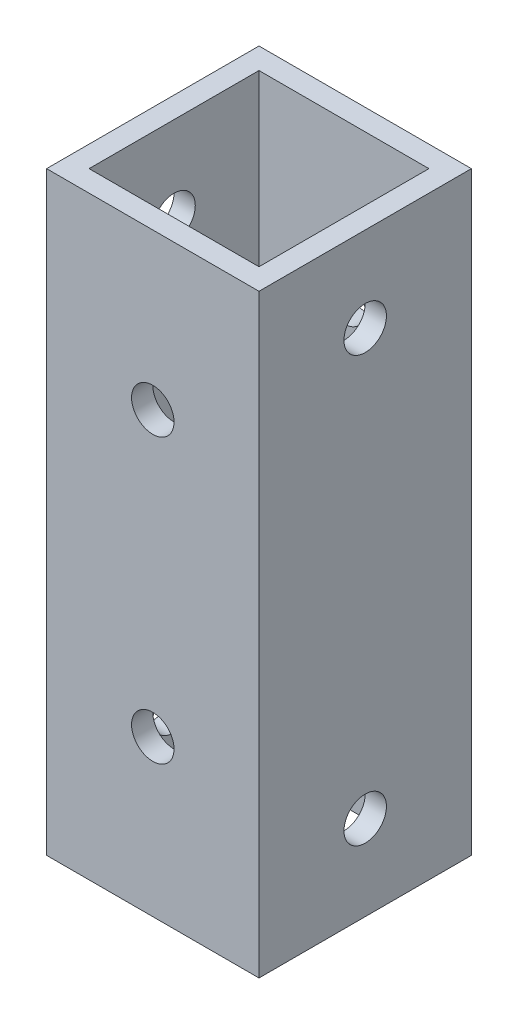
ISO-10303-21;
HEADER;
FILE_DESCRIPTION(('STEP AP214'),'2;1');
FILE_NAME('part.step','',(''),(''),'','','');
FILE_SCHEMA(('AUTOMOTIVE_DESIGN { 1 0 10303 214 1 1 1 1 }'));
ENDSEC;
DATA;
#1=APPLICATION_CONTEXT('core data for automotive mechanical design processes');
#2=APPLICATION_PROTOCOL_DEFINITION('international standard','automotive_design',2000,#1);
#3=PRODUCT_CONTEXT('',#1,'mechanical');
#4=PRODUCT('Part','Part','',(#3));
#5=PRODUCT_RELATED_PRODUCT_CATEGORY('part','',(#4));
#6=PRODUCT_DEFINITION_FORMATION('','',#4);
#7=PRODUCT_DEFINITION_CONTEXT('part definition',#1,'design');
#8=PRODUCT_DEFINITION('design','',#6,#7);
#9=PRODUCT_DEFINITION_SHAPE('','',#8);
#10=(LENGTH_UNIT() NAMED_UNIT(*) SI_UNIT(.MILLI.,.METRE.));
#11=(NAMED_UNIT(*) PLANE_ANGLE_UNIT() SI_UNIT($,.RADIAN.));
#12=(NAMED_UNIT(*) SI_UNIT($,.STERADIAN.) SOLID_ANGLE_UNIT());
#13=UNCERTAINTY_MEASURE_WITH_UNIT(LENGTH_MEASURE(1.E-05),#10,'distance_accuracy_value','');
#14=(GEOMETRIC_REPRESENTATION_CONTEXT(3) GLOBAL_UNCERTAINTY_ASSIGNED_CONTEXT((#13)) GLOBAL_UNIT_ASSIGNED_CONTEXT((#10,
#11,#12)) REPRESENTATION_CONTEXT('',''));
#15=CARTESIAN_POINT('',(0.,0.,0.));
#16=DIRECTION('',(0.,0.,1.));
#17=DIRECTION('',(1.,0.,0.));
#18=AXIS2_PLACEMENT_3D('',#15,#16,#17);
#19=CARTESIAN_POINT('',(0.,42.,0.));
#20=DIRECTION('',(0.,1.,0.));
#21=DIRECTION('',(0.,0.,1.));
#22=AXIS2_PLACEMENT_3D('',#19,#20,#21);
#23=PLANE('',#22);
#24=DIRECTION('',(0.,0.,1.));
#25=VECTOR('',#24,1.);
#26=CARTESIAN_POINT('',(0.,42.,0.));
#27=LINE('',#26,#25);
#28=CARTESIAN_POINT('',(0.,42.,-15.));
#29=VERTEX_POINT('',#28);
#30=CARTESIAN_POINT('',(0.,42.,0.));
#31=VERTEX_POINT('',#30);
#32=EDGE_CURVE('E186',#29,#31,#27,.T.);
#33=ORIENTED_EDGE('',*,*,#32,.T.);
#34=DIRECTION('',(1.,0.,0.));
#35=VECTOR('',#34,1.);
#36=CARTESIAN_POINT('',(0.,42.,0.));
#37=LINE('',#36,#35);
#38=CARTESIAN_POINT('',(15.,42.,0.));
#39=VERTEX_POINT('',#38);
#40=EDGE_CURVE('E190',#31,#39,#37,.T.);
#41=ORIENTED_EDGE('',*,*,#40,.T.);
#42=DIRECTION('',(0.,0.,-1.));
#43=VECTOR('',#42,1.);
#44=CARTESIAN_POINT('',(15.,42.,0.));
#45=LINE('',#44,#43);
#46=CARTESIAN_POINT('',(15.,42.,-15.));
#47=VERTEX_POINT('',#46);
#48=EDGE_CURVE('E194',#39,#47,#45,.T.);
#49=ORIENTED_EDGE('',*,*,#48,.T.);
#50=DIRECTION('',(-1.,0.,0.));
#51=VECTOR('',#50,1.);
#52=CARTESIAN_POINT('',(0.,42.,-15.));
#53=LINE('',#52,#51);
#54=EDGE_CURVE('E197',#47,#29,#53,.T.);
#55=ORIENTED_EDGE('',*,*,#54,.T.);
#56=EDGE_LOOP('',(#33,#41,#49,#55));
#57=FACE_BOUND('',#56,.T.);
#58=DIRECTION('',(1.,0.,0.));
#59=VECTOR('',#58,1.);
#60=CARTESIAN_POINT('',(0.,42.,-1.5));
#61=LINE('',#60,#59);
#62=CARTESIAN_POINT('',(1.5,42.,-1.5));
#63=VERTEX_POINT('',#62);
#64=CARTESIAN_POINT('',(13.5,42.,-1.5));
#65=VERTEX_POINT('',#64);
#66=EDGE_CURVE('E145',#63,#65,#61,.T.);
#67=ORIENTED_EDGE('',*,*,#66,.F.);
#68=DIRECTION('',(0.,0.,1.));
#69=VECTOR('',#68,1.);
#70=CARTESIAN_POINT('',(1.5,42.,0.));
#71=LINE('',#70,#69);
#72=CARTESIAN_POINT('',(1.5,42.,-13.5));
#73=VERTEX_POINT('',#72);
#74=EDGE_CURVE('E136',#73,#63,#71,.T.);
#75=ORIENTED_EDGE('',*,*,#74,.F.);
#76=DIRECTION('',(-1.,0.,0.));
#77=VECTOR('',#76,1.);
#78=CARTESIAN_POINT('',(0.,42.,-13.5));
#79=LINE('',#78,#77);
#80=CARTESIAN_POINT('',(13.5,42.,-13.5));
#81=VERTEX_POINT('',#80);
#82=EDGE_CURVE('E162',#81,#73,#79,.T.);
#83=ORIENTED_EDGE('',*,*,#82,.F.);
#84=DIRECTION('',(0.,0.,-1.));
#85=VECTOR('',#84,1.);
#86=CARTESIAN_POINT('',(13.5,42.,0.));
#87=LINE('',#86,#85);
#88=EDGE_CURVE('E158',#65,#81,#87,.T.);
#89=ORIENTED_EDGE('',*,*,#88,.F.);
#90=EDGE_LOOP('',(#67,#75,#83,#89));
#91=FACE_BOUND('',#90,.T.);
#92=ADVANCED_FACE('F68',(#57,#91),#23,.T.);
#93=CARTESIAN_POINT('',(0.,0.,0.));
#94=DIRECTION('',(0.,1.,0.));
#95=DIRECTION('',(0.,0.,1.));
#96=AXIS2_PLACEMENT_3D('',#93,#94,#95);
#97=PLANE('',#96);
#98=DIRECTION('',(0.,0.,1.));
#99=VECTOR('',#98,1.);
#100=CARTESIAN_POINT('',(0.,0.,0.));
#101=LINE('',#100,#99);
#102=CARTESIAN_POINT('',(0.,0.,-15.));
#103=VERTEX_POINT('',#102);
#104=CARTESIAN_POINT('',(0.,0.,0.));
#105=VERTEX_POINT('',#104);
#106=EDGE_CURVE('E154',#103,#105,#101,.T.);
#107=ORIENTED_EDGE('',*,*,#106,.F.);
#108=DIRECTION('',(-1.,0.,0.));
#109=VECTOR('',#108,1.);
#110=CARTESIAN_POINT('',(0.,0.,-15.));
#111=LINE('',#110,#109);
#112=CARTESIAN_POINT('',(15.,0.,-15.));
#113=VERTEX_POINT('',#112);
#114=EDGE_CURVE('E191',#113,#103,#111,.T.);
#115=ORIENTED_EDGE('',*,*,#114,.F.);
#116=DIRECTION('',(0.,0.,-1.));
#117=VECTOR('',#116,1.);
#118=CARTESIAN_POINT('',(15.,0.,0.));
#119=LINE('',#118,#117);
#120=CARTESIAN_POINT('',(15.,0.,0.));
#121=VERTEX_POINT('',#120);
#122=EDGE_CURVE('E207',#121,#113,#119,.T.);
#123=ORIENTED_EDGE('',*,*,#122,.F.);
#124=DIRECTION('',(1.,0.,0.));
#125=VECTOR('',#124,1.);
#126=CARTESIAN_POINT('',(0.,0.,0.));
#127=LINE('',#126,#125);
#128=EDGE_CURVE('E204',#105,#121,#127,.T.);
#129=ORIENTED_EDGE('',*,*,#128,.F.);
#130=EDGE_LOOP('',(#107,#115,#123,#129));
#131=FACE_BOUND('',#130,.T.);
#132=DIRECTION('',(0.,0.,1.));
#133=VECTOR('',#132,1.);
#134=CARTESIAN_POINT('',(1.5,0.,0.));
#135=LINE('',#134,#133);
#136=CARTESIAN_POINT('',(1.5,0.,-13.5));
#137=VERTEX_POINT('',#136);
#138=CARTESIAN_POINT('',(1.5,0.,-1.5));
#139=VERTEX_POINT('',#138);
#140=EDGE_CURVE('E94',#137,#139,#135,.T.);
#141=ORIENTED_EDGE('',*,*,#140,.T.);
#142=DIRECTION('',(1.,0.,0.));
#143=VECTOR('',#142,1.);
#144=CARTESIAN_POINT('',(0.,0.,-1.5));
#145=LINE('',#144,#143);
#146=CARTESIAN_POINT('',(13.5,0.,-1.5));
#147=VERTEX_POINT('',#146);
#148=EDGE_CURVE('E152',#139,#147,#145,.T.);
#149=ORIENTED_EDGE('',*,*,#148,.T.);
#150=DIRECTION('',(0.,0.,-1.));
#151=VECTOR('',#150,1.);
#152=CARTESIAN_POINT('',(13.5,0.,0.));
#153=LINE('',#152,#151);
#154=CARTESIAN_POINT('',(13.5,0.,-13.5));
#155=VERTEX_POINT('',#154);
#156=EDGE_CURVE('E173',#147,#155,#153,.T.);
#157=ORIENTED_EDGE('',*,*,#156,.T.);
#158=DIRECTION('',(-1.,0.,0.));
#159=VECTOR('',#158,1.);
#160=CARTESIAN_POINT('',(0.,0.,-13.5));
#161=LINE('',#160,#159);
#162=EDGE_CURVE('E146',#155,#137,#161,.T.);
#163=ORIENTED_EDGE('',*,*,#162,.T.);
#164=EDGE_LOOP('',(#141,#149,#157,#163));
#165=FACE_BOUND('',#164,.T.);
#166=ADVANCED_FACE('F304',(#131,#165),#97,.F.);
#167=CARTESIAN_POINT('',(0.,42.,0.));
#168=DIRECTION('',(1.,0.,0.));
#169=DIRECTION('',(0.,0.,-1.));
#170=AXIS2_PLACEMENT_3D('',#167,#168,#169);
#171=PLANE('',#170);
#172=CARTESIAN_POINT('',(0.,35.9999999999963,-7.49999999999515));
#173=DIRECTION('',(-1.,0.,0.));
#174=DIRECTION('',(0.,0.,1.));
#175=AXIS2_PLACEMENT_3D('',#172,#173,#174);
#176=CIRCLE('',#175,1.5);
#177=CARTESIAN_POINT('',(0.,35.9999999999963,-5.99999999999515));
#178=VERTEX_POINT('',#177);
#179=EDGE_CURVE('E267',#178,#178,#176,.T.);
#180=ORIENTED_EDGE('',*,*,#179,.F.);
#181=EDGE_LOOP('',(#180));
#182=FACE_BOUND('',#181,.T.);
#183=CARTESIAN_POINT('',(0.,5.99999999999631,-7.49999999999523));
#184=DIRECTION('',(-1.,0.,0.));
#185=DIRECTION('',(0.,0.,1.));
#186=AXIS2_PLACEMENT_3D('',#183,#184,#185);
#187=CIRCLE('',#186,1.5);
#188=CARTESIAN_POINT('',(0.,5.99999999999631,-5.99999999999523));
#189=VERTEX_POINT('',#188);
#190=EDGE_CURVE('E271',#189,#189,#187,.T.);
#191=ORIENTED_EDGE('',*,*,#190,.F.);
#192=EDGE_LOOP('',(#191));
#193=FACE_BOUND('',#192,.T.);
#194=ORIENTED_EDGE('',*,*,#106,.T.);
#195=DIRECTION('',(0.,-1.,0.));
#196=VECTOR('',#195,1.);
#197=CARTESIAN_POINT('',(0.,42.,0.));
#198=LINE('',#197,#196);
#199=EDGE_CURVE('E12',#31,#105,#198,.T.);
#200=ORIENTED_EDGE('',*,*,#199,.F.);
#201=ORIENTED_EDGE('',*,*,#32,.F.);
#202=DIRECTION('',(0.,-1.,0.));
#203=VECTOR('',#202,1.);
#204=CARTESIAN_POINT('',(0.,42.,-15.));
#205=LINE('',#204,#203);
#206=EDGE_CURVE('E200',#29,#103,#205,.T.);
#207=ORIENTED_EDGE('',*,*,#206,.T.);
#208=EDGE_LOOP('',(#194,#200,#201,#207));
#209=FACE_BOUND('',#208,.T.);
#210=ADVANCED_FACE('F70',(#182,#193,#209),#171,.F.);
#211=CARTESIAN_POINT('',(0.,42.,0.));
#212=DIRECTION('',(0.,0.,-1.));
#213=DIRECTION('',(-1.,0.,0.));
#214=AXIS2_PLACEMENT_3D('',#211,#212,#213);
#215=PLANE('',#214);
#216=CARTESIAN_POINT('',(7.5,31.,0.));
#217=DIRECTION('',(0.,0.,-1.));
#218=DIRECTION('',(-1.,0.,0.));
#219=AXIS2_PLACEMENT_3D('',#216,#217,#218);
#220=CIRCLE('',#219,1.5);
#221=CARTESIAN_POINT('',(6.,31.,0.));
#222=VERTEX_POINT('',#221);
#223=EDGE_CURVE('E235',#222,#222,#220,.T.);
#224=ORIENTED_EDGE('',*,*,#223,.T.);
#225=EDGE_LOOP('',(#224));
#226=FACE_BOUND('',#225,.T.);
#227=CARTESIAN_POINT('',(7.5,11.,0.));
#228=DIRECTION('',(0.,0.,-1.));
#229=DIRECTION('',(-1.,0.,0.));
#230=AXIS2_PLACEMENT_3D('',#227,#228,#229);
#231=CIRCLE('',#230,1.5);
#232=CARTESIAN_POINT('',(6.,11.,0.));
#233=VERTEX_POINT('',#232);
#234=EDGE_CURVE('E255',#233,#233,#231,.T.);
#235=ORIENTED_EDGE('',*,*,#234,.T.);
#236=EDGE_LOOP('',(#235));
#237=FACE_BOUND('',#236,.T.);
#238=ORIENTED_EDGE('',*,*,#128,.T.);
#239=DIRECTION('',(0.,-1.,0.));
#240=VECTOR('',#239,1.);
#241=CARTESIAN_POINT('',(15.,42.,0.));
#242=LINE('',#241,#240);
#243=EDGE_CURVE('E78',#39,#121,#242,.T.);
#244=ORIENTED_EDGE('',*,*,#243,.F.);
#245=ORIENTED_EDGE('',*,*,#40,.F.);
#246=ORIENTED_EDGE('',*,*,#199,.T.);
#247=EDGE_LOOP('',(#238,#244,#245,#246));
#248=FACE_BOUND('',#247,.T.);
#249=ADVANCED_FACE('F303',(#226,#237,#248),#215,.F.);
#250=CARTESIAN_POINT('',(15.,42.,0.));
#251=DIRECTION('',(-1.,0.,0.));
#252=DIRECTION('',(0.,0.,1.));
#253=AXIS2_PLACEMENT_3D('',#250,#251,#252);
#254=PLANE('',#253);
#255=CARTESIAN_POINT('',(15.,35.9999999999963,-7.49999999999515));
#256=DIRECTION('',(-1.,0.,0.));
#257=DIRECTION('',(0.,0.,1.));
#258=AXIS2_PLACEMENT_3D('',#255,#256,#257);
#259=CIRCLE('',#258,1.5);
#260=CARTESIAN_POINT('',(15.,35.9999999999963,-5.99999999999515));
#261=VERTEX_POINT('',#260);
#262=EDGE_CURVE('E227',#261,#261,#259,.T.);
#263=ORIENTED_EDGE('',*,*,#262,.T.);
#264=EDGE_LOOP('',(#263));
#265=FACE_BOUND('',#264,.T.);
#266=CARTESIAN_POINT('',(15.,5.99999999999631,-7.49999999999523));
#267=DIRECTION('',(-1.,0.,0.));
#268=DIRECTION('',(0.,0.,1.));
#269=AXIS2_PLACEMENT_3D('',#266,#267,#268);
#270=CIRCLE('',#269,1.5);
#271=CARTESIAN_POINT('',(15.,5.99999999999631,-5.99999999999523));
#272=VERTEX_POINT('',#271);
#273=EDGE_CURVE('E263',#272,#272,#270,.T.);
#274=ORIENTED_EDGE('',*,*,#273,.T.);
#275=EDGE_LOOP('',(#274));
#276=FACE_BOUND('',#275,.T.);
#277=ORIENTED_EDGE('',*,*,#122,.T.);
#278=DIRECTION('',(0.,-1.,0.));
#279=VECTOR('',#278,1.);
#280=CARTESIAN_POINT('',(15.,42.,-15.));
#281=LINE('',#280,#279);
#282=EDGE_CURVE('E215',#47,#113,#281,.T.);
#283=ORIENTED_EDGE('',*,*,#282,.F.);
#284=ORIENTED_EDGE('',*,*,#48,.F.);
#285=ORIENTED_EDGE('',*,*,#243,.T.);
#286=EDGE_LOOP('',(#277,#283,#284,#285));
#287=FACE_BOUND('',#286,.T.);
#288=ADVANCED_FACE('F322',(#265,#276,#287),#254,.F.);
#289=CARTESIAN_POINT('',(0.,42.,-15.));
#290=DIRECTION('',(0.,0.,1.));
#291=DIRECTION('',(1.,0.,0.));
#292=AXIS2_PLACEMENT_3D('',#289,#290,#291);
#293=PLANE('',#292);
#294=CARTESIAN_POINT('',(7.5,31.,-15.));
#295=DIRECTION('',(0.,0.,-1.));
#296=DIRECTION('',(-1.,0.,0.));
#297=AXIS2_PLACEMENT_3D('',#294,#295,#296);
#298=CIRCLE('',#297,1.5);
#299=CARTESIAN_POINT('',(6.,31.,-15.));
#300=VERTEX_POINT('',#299);
#301=EDGE_CURVE('E243',#300,#300,#298,.T.);
#302=ORIENTED_EDGE('',*,*,#301,.F.);
#303=EDGE_LOOP('',(#302));
#304=FACE_BOUND('',#303,.T.);
#305=CARTESIAN_POINT('',(7.5,11.,-15.));
#306=DIRECTION('',(0.,0.,-1.));
#307=DIRECTION('',(-1.,0.,0.));
#308=AXIS2_PLACEMENT_3D('',#305,#306,#307);
#309=CIRCLE('',#308,1.5);
#310=CARTESIAN_POINT('',(6.,11.,-15.));
#311=VERTEX_POINT('',#310);
#312=EDGE_CURVE('E249',#311,#311,#309,.T.);
#313=ORIENTED_EDGE('',*,*,#312,.F.);
#314=EDGE_LOOP('',(#313));
#315=FACE_BOUND('',#314,.T.);
#316=ORIENTED_EDGE('',*,*,#114,.T.);
#317=ORIENTED_EDGE('',*,*,#206,.F.);
#318=ORIENTED_EDGE('',*,*,#54,.F.);
#319=ORIENTED_EDGE('',*,*,#282,.T.);
#320=EDGE_LOOP('',(#316,#317,#318,#319));
#321=FACE_BOUND('',#320,.T.);
#322=ADVANCED_FACE('F289',(#304,#315,#321),#293,.F.);
#323=CARTESIAN_POINT('',(1.5,42.,0.));
#324=DIRECTION('',(1.,0.,0.));
#325=DIRECTION('',(0.,0.,-1.));
#326=AXIS2_PLACEMENT_3D('',#323,#324,#325);
#327=PLANE('',#326);
#328=CARTESIAN_POINT('',(1.5,35.9999999999963,-7.49999999999515));
#329=DIRECTION('',(1.,0.,0.));
#330=DIRECTION('',(0.,0.,-1.));
#331=AXIS2_PLACEMENT_3D('',#328,#329,#330);
#332=CIRCLE('',#331,1.5);
#333=CARTESIAN_POINT('',(1.5,35.9999999999963,-8.99999999999515));
#334=VERTEX_POINT('',#333);
#335=EDGE_CURVE('E170',#334,#334,#332,.T.);
#336=ORIENTED_EDGE('',*,*,#335,.F.);
#337=EDGE_LOOP('',(#336));
#338=FACE_BOUND('',#337,.T.);
#339=CARTESIAN_POINT('',(1.5,5.99999999999631,-7.49999999999523));
#340=DIRECTION('',(1.,0.,0.));
#341=DIRECTION('',(0.,0.,-1.));
#342=AXIS2_PLACEMENT_3D('',#339,#340,#341);
#343=CIRCLE('',#342,1.5);
#344=CARTESIAN_POINT('',(1.5,5.99999999999631,-8.99999999999523));
#345=VERTEX_POINT('',#344);
#346=EDGE_CURVE('E226',#345,#345,#343,.T.);
#347=ORIENTED_EDGE('',*,*,#346,.F.);
#348=EDGE_LOOP('',(#347));
#349=FACE_BOUND('',#348,.T.);
#350=ORIENTED_EDGE('',*,*,#140,.F.);
#351=DIRECTION('',(0.,-1.,0.));
#352=VECTOR('',#351,1.);
#353=CARTESIAN_POINT('',(1.5,42.,-13.5));
#354=LINE('',#353,#352);
#355=EDGE_CURVE('E140',#73,#137,#354,.T.);
#356=ORIENTED_EDGE('',*,*,#355,.F.);
#357=ORIENTED_EDGE('',*,*,#74,.T.);
#358=DIRECTION('',(0.,-1.,0.));
#359=VECTOR('',#358,1.);
#360=CARTESIAN_POINT('',(1.5,42.,-1.5));
#361=LINE('',#360,#359);
#362=EDGE_CURVE('E139',#63,#139,#361,.T.);
#363=ORIENTED_EDGE('',*,*,#362,.T.);
#364=EDGE_LOOP('',(#350,#356,#357,#363));
#365=FACE_BOUND('',#364,.T.);
#366=ADVANCED_FACE('F138',(#338,#349,#365),#327,.T.);
#367=CARTESIAN_POINT('',(0.,42.,-1.5));
#368=DIRECTION('',(0.,0.,-1.));
#369=DIRECTION('',(-1.,0.,0.));
#370=AXIS2_PLACEMENT_3D('',#367,#368,#369);
#371=PLANE('',#370);
#372=CARTESIAN_POINT('',(7.5,31.,-1.5));
#373=DIRECTION('',(0.,0.,-1.));
#374=DIRECTION('',(-1.,0.,0.));
#375=AXIS2_PLACEMENT_3D('',#372,#373,#374);
#376=CIRCLE('',#375,1.5);
#377=CARTESIAN_POINT('',(6.,31.,-1.5));
#378=VERTEX_POINT('',#377);
#379=EDGE_CURVE('E259',#378,#378,#376,.T.);
#380=ORIENTED_EDGE('',*,*,#379,.F.);
#381=EDGE_LOOP('',(#380));
#382=FACE_BOUND('',#381,.T.);
#383=CARTESIAN_POINT('',(7.5,11.,-1.5));
#384=DIRECTION('',(0.,0.,-1.));
#385=DIRECTION('',(-1.,0.,0.));
#386=AXIS2_PLACEMENT_3D('',#383,#384,#385);
#387=CIRCLE('',#386,1.5);
#388=CARTESIAN_POINT('',(6.,11.,-1.5));
#389=VERTEX_POINT('',#388);
#390=EDGE_CURVE('E234',#389,#389,#387,.T.);
#391=ORIENTED_EDGE('',*,*,#390,.F.);
#392=EDGE_LOOP('',(#391));
#393=FACE_BOUND('',#392,.T.);
#394=ORIENTED_EDGE('',*,*,#148,.F.);
#395=ORIENTED_EDGE('',*,*,#362,.F.);
#396=ORIENTED_EDGE('',*,*,#66,.T.);
#397=DIRECTION('',(0.,-1.,0.));
#398=VECTOR('',#397,1.);
#399=CARTESIAN_POINT('',(13.5,42.,-1.5));
#400=LINE('',#399,#398);
#401=EDGE_CURVE('E155',#65,#147,#400,.T.);
#402=ORIENTED_EDGE('',*,*,#401,.T.);
#403=EDGE_LOOP('',(#394,#395,#396,#402));
#404=FACE_BOUND('',#403,.T.);
#405=ADVANCED_FACE('F149',(#382,#393,#404),#371,.T.);
#406=CARTESIAN_POINT('',(13.5,42.,0.));
#407=DIRECTION('',(-1.,0.,0.));
#408=DIRECTION('',(0.,0.,1.));
#409=AXIS2_PLACEMENT_3D('',#406,#407,#408);
#410=PLANE('',#409);
#411=CARTESIAN_POINT('',(13.5,35.9999999999963,-7.49999999999515));
#412=DIRECTION('',(-1.,0.,0.));
#413=DIRECTION('',(0.,0.,1.));
#414=AXIS2_PLACEMENT_3D('',#411,#412,#413);
#415=CIRCLE('',#414,1.5);
#416=CARTESIAN_POINT('',(13.5,35.9999999999963,-5.99999999999515));
#417=VERTEX_POINT('',#416);
#418=EDGE_CURVE('E228',#417,#417,#415,.T.);
#419=ORIENTED_EDGE('',*,*,#418,.F.);
#420=EDGE_LOOP('',(#419));
#421=FACE_BOUND('',#420,.T.);
#422=CARTESIAN_POINT('',(13.5,5.99999999999631,-7.49999999999523));
#423=DIRECTION('',(-1.,0.,0.));
#424=DIRECTION('',(0.,0.,1.));
#425=AXIS2_PLACEMENT_3D('',#422,#423,#424);
#426=CIRCLE('',#425,1.5);
#427=CARTESIAN_POINT('',(13.5,5.99999999999631,-5.99999999999523));
#428=VERTEX_POINT('',#427);
#429=EDGE_CURVE('E222',#428,#428,#426,.T.);
#430=ORIENTED_EDGE('',*,*,#429,.F.);
#431=EDGE_LOOP('',(#430));
#432=FACE_BOUND('',#431,.T.);
#433=ORIENTED_EDGE('',*,*,#156,.F.);
#434=ORIENTED_EDGE('',*,*,#401,.F.);
#435=ORIENTED_EDGE('',*,*,#88,.T.);
#436=DIRECTION('',(0.,-1.,0.));
#437=VECTOR('',#436,1.);
#438=CARTESIAN_POINT('',(13.5,42.,-13.5));
#439=LINE('',#438,#437);
#440=EDGE_CURVE('E86',#81,#155,#439,.T.);
#441=ORIENTED_EDGE('',*,*,#440,.T.);
#442=EDGE_LOOP('',(#433,#434,#435,#441));
#443=FACE_BOUND('',#442,.T.);
#444=ADVANCED_FACE('F342',(#421,#432,#443),#410,.T.);
#445=CARTESIAN_POINT('',(0.,42.,-13.5));
#446=DIRECTION('',(0.,0.,1.));
#447=DIRECTION('',(1.,0.,0.));
#448=AXIS2_PLACEMENT_3D('',#445,#446,#447);
#449=PLANE('',#448);
#450=CARTESIAN_POINT('',(7.5,31.,-13.5));
#451=DIRECTION('',(0.,0.,1.));
#452=DIRECTION('',(1.,0.,0.));
#453=AXIS2_PLACEMENT_3D('',#450,#451,#452);
#454=CIRCLE('',#453,1.5);
#455=CARTESIAN_POINT('',(9.,31.,-13.5));
#456=VERTEX_POINT('',#455);
#457=EDGE_CURVE('E72',#456,#456,#454,.T.);
#458=ORIENTED_EDGE('',*,*,#457,.F.);
#459=EDGE_LOOP('',(#458));
#460=FACE_BOUND('',#459,.T.);
#461=CARTESIAN_POINT('',(7.5,11.,-13.5));
#462=DIRECTION('',(0.,0.,1.));
#463=DIRECTION('',(1.,0.,0.));
#464=AXIS2_PLACEMENT_3D('',#461,#462,#463);
#465=CIRCLE('',#464,1.5);
#466=CARTESIAN_POINT('',(9.,11.,-13.5));
#467=VERTEX_POINT('',#466);
#468=EDGE_CURVE('E231',#467,#467,#465,.T.);
#469=ORIENTED_EDGE('',*,*,#468,.F.);
#470=EDGE_LOOP('',(#469));
#471=FACE_BOUND('',#470,.T.);
#472=ORIENTED_EDGE('',*,*,#162,.F.);
#473=ORIENTED_EDGE('',*,*,#440,.F.);
#474=ORIENTED_EDGE('',*,*,#82,.T.);
#475=ORIENTED_EDGE('',*,*,#355,.T.);
#476=EDGE_LOOP('',(#472,#473,#474,#475));
#477=FACE_BOUND('',#476,.T.);
#478=ADVANCED_FACE('F346',(#460,#471,#477),#449,.T.);
#479=CARTESIAN_POINT('',(15.,5.99999999999631,-7.49999999999523));
#480=DIRECTION('',(-1.,0.,0.));
#481=DIRECTION('',(0.,0.,1.));
#482=AXIS2_PLACEMENT_3D('',#479,#480,#481);
#483=CYLINDRICAL_SURFACE('',#482,1.5);
#484=ORIENTED_EDGE('',*,*,#429,.T.);
#485=EDGE_LOOP('',(#484));
#486=FACE_BOUND('',#485,.T.);
#487=ORIENTED_EDGE('',*,*,#273,.F.);
#488=EDGE_LOOP('',(#487));
#489=FACE_BOUND('',#488,.T.);
#490=ADVANCED_FACE('F298',(#486,#489),#483,.F.);
#491=CARTESIAN_POINT('',(15.,35.9999999999963,-7.49999999999515));
#492=DIRECTION('',(-1.,0.,0.));
#493=DIRECTION('',(0.,0.,1.));
#494=AXIS2_PLACEMENT_3D('',#491,#492,#493);
#495=CYLINDRICAL_SURFACE('',#494,1.5);
#496=ORIENTED_EDGE('',*,*,#418,.T.);
#497=EDGE_LOOP('',(#496));
#498=FACE_BOUND('',#497,.T.);
#499=ORIENTED_EDGE('',*,*,#262,.F.);
#500=EDGE_LOOP('',(#499));
#501=FACE_BOUND('',#500,.T.);
#502=ADVANCED_FACE('F296',(#498,#501),#495,.F.);
#503=ORIENTED_EDGE('',*,*,#346,.T.);
#504=EDGE_LOOP('',(#503));
#505=FACE_BOUND('',#504,.T.);
#506=ORIENTED_EDGE('',*,*,#190,.T.);
#507=EDGE_LOOP('',(#506));
#508=FACE_BOUND('',#507,.T.);
#509=ADVANCED_FACE('F293',(#505,#508),#483,.F.);
#510=ORIENTED_EDGE('',*,*,#335,.T.);
#511=EDGE_LOOP('',(#510));
#512=FACE_BOUND('',#511,.T.);
#513=ORIENTED_EDGE('',*,*,#179,.T.);
#514=EDGE_LOOP('',(#513));
#515=FACE_BOUND('',#514,.T.);
#516=ADVANCED_FACE('F284',(#512,#515),#495,.F.);
#517=CARTESIAN_POINT('',(7.5,11.,0.));
#518=DIRECTION('',(0.,0.,-1.));
#519=DIRECTION('',(-1.,0.,0.));
#520=AXIS2_PLACEMENT_3D('',#517,#518,#519);
#521=CYLINDRICAL_SURFACE('',#520,1.5);
#522=ORIENTED_EDGE('',*,*,#468,.T.);
#523=EDGE_LOOP('',(#522));
#524=FACE_BOUND('',#523,.T.);
#525=ORIENTED_EDGE('',*,*,#312,.T.);
#526=EDGE_LOOP('',(#525));
#527=FACE_BOUND('',#526,.T.);
#528=ADVANCED_FACE('F356',(#524,#527),#521,.F.);
#529=CARTESIAN_POINT('',(7.5,31.,0.));
#530=DIRECTION('',(0.,0.,-1.));
#531=DIRECTION('',(-1.,0.,0.));
#532=AXIS2_PLACEMENT_3D('',#529,#530,#531);
#533=CYLINDRICAL_SURFACE('',#532,1.5);
#534=ORIENTED_EDGE('',*,*,#457,.T.);
#535=EDGE_LOOP('',(#534));
#536=FACE_BOUND('',#535,.T.);
#537=ORIENTED_EDGE('',*,*,#301,.T.);
#538=EDGE_LOOP('',(#537));
#539=FACE_BOUND('',#538,.T.);
#540=ADVANCED_FACE('F359',(#536,#539),#533,.F.);
#541=ORIENTED_EDGE('',*,*,#390,.T.);
#542=EDGE_LOOP('',(#541));
#543=FACE_BOUND('',#542,.T.);
#544=ORIENTED_EDGE('',*,*,#234,.F.);
#545=EDGE_LOOP('',(#544));
#546=FACE_BOUND('',#545,.T.);
#547=ADVANCED_FACE('F360',(#543,#546),#521,.F.);
#548=ORIENTED_EDGE('',*,*,#379,.T.);
#549=EDGE_LOOP('',(#548));
#550=FACE_BOUND('',#549,.T.);
#551=ORIENTED_EDGE('',*,*,#223,.F.);
#552=EDGE_LOOP('',(#551));
#553=FACE_BOUND('',#552,.T.);
#554=ADVANCED_FACE('F363',(#550,#553),#533,.F.);
#555=CLOSED_SHELL('',(#92,#166,#210,#249,#288,#322,#366,#405,#444,#478,#490,#502,#509,#516,#528,
#540,#547,#554));
#556=MANIFOLD_SOLID_BREP('B2',#555);
#557=ADVANCED_BREP_SHAPE_REPRESENTATION('',(#18,#556),#14);
#558=SHAPE_DEFINITION_REPRESENTATION(#9,#557);
ENDSEC;
END-ISO-10303-21;
